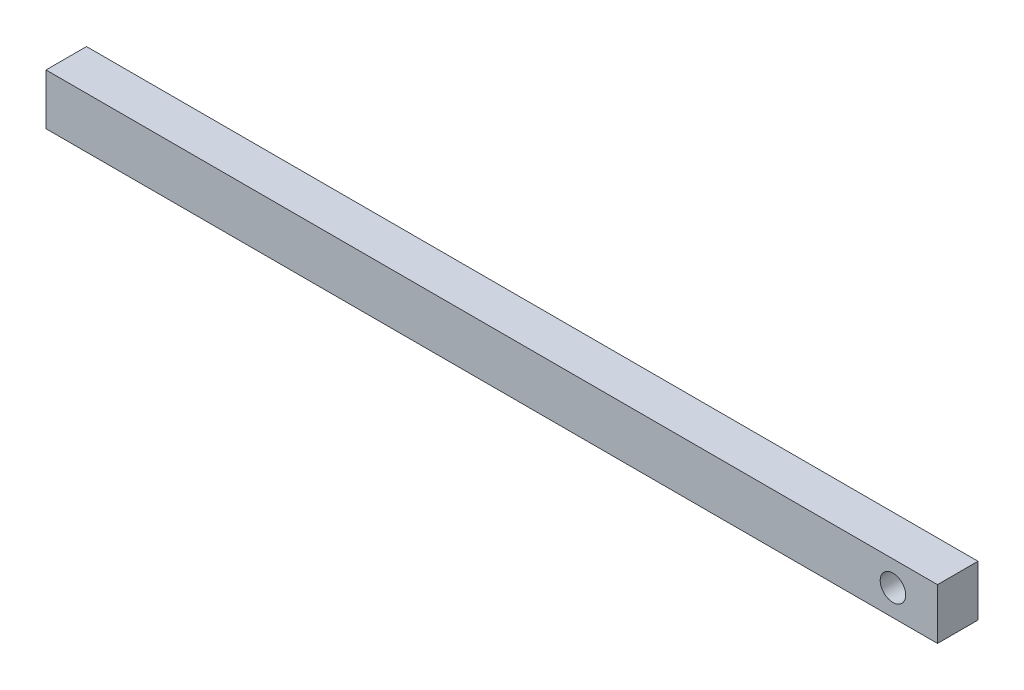
ISO-10303-21;
HEADER;
FILE_DESCRIPTION(('STEP AP214'),'2;1');
FILE_NAME('part.step','',(''),(''),'','','');
FILE_SCHEMA(('AUTOMOTIVE_DESIGN { 1 0 10303 214 1 1 1 1 }'));
ENDSEC;
DATA;
#1=APPLICATION_CONTEXT('core data for automotive mechanical design processes');
#2=APPLICATION_PROTOCOL_DEFINITION('international standard','automotive_design',2000,#1);
#3=PRODUCT_CONTEXT('',#1,'mechanical');
#4=PRODUCT('Part','Part','',(#3));
#5=PRODUCT_RELATED_PRODUCT_CATEGORY('part','',(#4));
#6=PRODUCT_DEFINITION_FORMATION('','',#4);
#7=PRODUCT_DEFINITION_CONTEXT('part definition',#1,'design');
#8=PRODUCT_DEFINITION('design','',#6,#7);
#9=PRODUCT_DEFINITION_SHAPE('','',#8);
#10=(LENGTH_UNIT() NAMED_UNIT(*) SI_UNIT(.MILLI.,.METRE.));
#11=(NAMED_UNIT(*) PLANE_ANGLE_UNIT() SI_UNIT($,.RADIAN.));
#12=(NAMED_UNIT(*) SI_UNIT($,.STERADIAN.) SOLID_ANGLE_UNIT());
#13=UNCERTAINTY_MEASURE_WITH_UNIT(LENGTH_MEASURE(1.E-05),#10,'distance_accuracy_value','');
#14=(GEOMETRIC_REPRESENTATION_CONTEXT(3) GLOBAL_UNCERTAINTY_ASSIGNED_CONTEXT((#13)) GLOBAL_UNIT_ASSIGNED_CONTEXT((#10,
#11,#12)) REPRESENTATION_CONTEXT('',''));
#15=CARTESIAN_POINT('',(0.,0.,0.));
#16=DIRECTION('',(0.,0.,1.));
#17=DIRECTION('',(1.,0.,0.));
#18=AXIS2_PLACEMENT_3D('',#15,#16,#17);
#19=CARTESIAN_POINT('',(0.,0.,3.18));
#20=DIRECTION('',(1.,0.,0.));
#21=DIRECTION('',(0.,0.,-1.));
#22=AXIS2_PLACEMENT_3D('',#19,#20,#21);
#23=PLANE('',#22);
#24=DIRECTION('',(0.,-1.,0.));
#25=VECTOR('',#24,1.);
#26=CARTESIAN_POINT('',(0.,0.,0.));
#27=LINE('',#26,#25);
#28=CARTESIAN_POINT('',(0.,4.,0.));
#29=VERTEX_POINT('',#28);
#30=CARTESIAN_POINT('',(0.,0.,0.));
#31=VERTEX_POINT('',#30);
#32=EDGE_CURVE('E101',#29,#31,#27,.T.);
#33=ORIENTED_EDGE('',*,*,#32,.T.);
#34=DIRECTION('',(0.,0.,-1.));
#35=VECTOR('',#34,1.);
#36=CARTESIAN_POINT('',(0.,0.,3.18));
#37=LINE('',#36,#35);
#38=CARTESIAN_POINT('',(0.,0.,3.18));
#39=VERTEX_POINT('',#38);
#40=EDGE_CURVE('E11',#39,#31,#37,.T.);
#41=ORIENTED_EDGE('',*,*,#40,.F.);
#42=DIRECTION('',(0.,-1.,0.));
#43=VECTOR('',#42,1.);
#44=CARTESIAN_POINT('',(0.,0.,3.18));
#45=LINE('',#44,#43);
#46=CARTESIAN_POINT('',(0.,4.,3.18));
#47=VERTEX_POINT('',#46);
#48=EDGE_CURVE('E88',#47,#39,#45,.T.);
#49=ORIENTED_EDGE('',*,*,#48,.F.);
#50=DIRECTION('',(0.,0.,-1.));
#51=VECTOR('',#50,1.);
#52=CARTESIAN_POINT('',(0.,4.,3.18));
#53=LINE('',#52,#51);
#54=EDGE_CURVE('E97',#47,#29,#53,.T.);
#55=ORIENTED_EDGE('',*,*,#54,.T.);
#56=EDGE_LOOP('',(#33,#41,#49,#55));
#57=FACE_BOUND('',#56,.T.);
#58=ADVANCED_FACE('F36',(#57),#23,.F.);
#59=CARTESIAN_POINT('',(0.,0.,3.18));
#60=DIRECTION('',(0.,1.,0.));
#61=DIRECTION('',(0.,0.,1.));
#62=AXIS2_PLACEMENT_3D('',#59,#60,#61);
#63=PLANE('',#62);
#64=DIRECTION('',(1.,0.,0.));
#65=VECTOR('',#64,1.);
#66=CARTESIAN_POINT('',(0.,0.,0.));
#67=LINE('',#66,#65);
#68=CARTESIAN_POINT('',(70.,0.,0.));
#69=VERTEX_POINT('',#68);
#70=EDGE_CURVE('E92',#31,#69,#67,.T.);
#71=ORIENTED_EDGE('',*,*,#70,.T.);
#72=DIRECTION('',(0.,0.,-1.));
#73=VECTOR('',#72,1.);
#74=CARTESIAN_POINT('',(70.,0.,3.18));
#75=LINE('',#74,#73);
#76=CARTESIAN_POINT('',(70.,0.,3.18));
#77=VERTEX_POINT('',#76);
#78=EDGE_CURVE('E45',#77,#69,#75,.T.);
#79=ORIENTED_EDGE('',*,*,#78,.F.);
#80=DIRECTION('',(1.,0.,0.));
#81=VECTOR('',#80,1.);
#82=CARTESIAN_POINT('',(0.,0.,3.18));
#83=LINE('',#82,#81);
#84=EDGE_CURVE('E83',#39,#77,#83,.T.);
#85=ORIENTED_EDGE('',*,*,#84,.F.);
#86=ORIENTED_EDGE('',*,*,#40,.T.);
#87=EDGE_LOOP('',(#71,#79,#85,#86));
#88=FACE_BOUND('',#87,.T.);
#89=ADVANCED_FACE('F91',(#88),#63,.F.);
#90=CARTESIAN_POINT('',(70.,0.,3.18));
#91=DIRECTION('',(-1.,0.,0.));
#92=DIRECTION('',(0.,0.,1.));
#93=AXIS2_PLACEMENT_3D('',#90,#91,#92);
#94=PLANE('',#93);
#95=DIRECTION('',(0.,1.,0.));
#96=VECTOR('',#95,1.);
#97=CARTESIAN_POINT('',(70.,0.,0.));
#98=LINE('',#97,#96);
#99=CARTESIAN_POINT('',(70.,4.,0.));
#100=VERTEX_POINT('',#99);
#101=EDGE_CURVE('E70',#69,#100,#98,.T.);
#102=ORIENTED_EDGE('',*,*,#101,.T.);
#103=DIRECTION('',(0.,0.,-1.));
#104=VECTOR('',#103,1.);
#105=CARTESIAN_POINT('',(70.,4.,3.18));
#106=LINE('',#105,#104);
#107=CARTESIAN_POINT('',(70.,4.,3.18));
#108=VERTEX_POINT('',#107);
#109=EDGE_CURVE('E93',#108,#100,#106,.T.);
#110=ORIENTED_EDGE('',*,*,#109,.F.);
#111=DIRECTION('',(0.,1.,0.));
#112=VECTOR('',#111,1.);
#113=CARTESIAN_POINT('',(70.,0.,3.18));
#114=LINE('',#113,#112);
#115=EDGE_CURVE('E86',#77,#108,#114,.T.);
#116=ORIENTED_EDGE('',*,*,#115,.F.);
#117=ORIENTED_EDGE('',*,*,#78,.T.);
#118=EDGE_LOOP('',(#102,#110,#116,#117));
#119=FACE_BOUND('',#118,.T.);
#120=ADVANCED_FACE('F95',(#119),#94,.F.);
#121=CARTESIAN_POINT('',(0.,4.,3.18));
#122=DIRECTION('',(0.,-1.,0.));
#123=DIRECTION('',(0.,0.,-1.));
#124=AXIS2_PLACEMENT_3D('',#121,#122,#123);
#125=PLANE('',#124);
#126=DIRECTION('',(-1.,0.,0.));
#127=VECTOR('',#126,1.);
#128=CARTESIAN_POINT('',(0.,4.,0.));
#129=LINE('',#128,#127);
#130=EDGE_CURVE('E76',#100,#29,#129,.T.);
#131=ORIENTED_EDGE('',*,*,#130,.T.);
#132=ORIENTED_EDGE('',*,*,#54,.F.);
#133=DIRECTION('',(-1.,0.,0.));
#134=VECTOR('',#133,1.);
#135=CARTESIAN_POINT('',(0.,4.,3.18));
#136=LINE('',#135,#134);
#137=EDGE_CURVE('E53',#108,#47,#136,.T.);
#138=ORIENTED_EDGE('',*,*,#137,.F.);
#139=ORIENTED_EDGE('',*,*,#109,.T.);
#140=EDGE_LOOP('',(#131,#132,#138,#139));
#141=FACE_BOUND('',#140,.T.);
#142=ADVANCED_FACE('F108',(#141),#125,.F.);
#143=CARTESIAN_POINT('',(0.,0.,3.18));
#144=DIRECTION('',(0.,0.,-1.));
#145=DIRECTION('',(-1.,0.,0.));
#146=AXIS2_PLACEMENT_3D('',#143,#144,#145);
#147=PLANE('',#146);
#148=CARTESIAN_POINT('',(66.5001733034826,2.03482950393317,3.18));
#149=DIRECTION('',(0.,0.,1.));
#150=DIRECTION('',(1.,0.,0.));
#151=AXIS2_PLACEMENT_3D('',#148,#149,#150);
#152=CIRCLE('',#151,0.999999999999998);
#153=CARTESIAN_POINT('',(67.5001733034826,2.03482950393317,3.18));
#154=VERTEX_POINT('',#153);
#155=EDGE_CURVE('E114',#154,#154,#152,.T.);
#156=ORIENTED_EDGE('',*,*,#155,.F.);
#157=EDGE_LOOP('',(#156));
#158=FACE_BOUND('',#157,.T.);
#159=ORIENTED_EDGE('',*,*,#48,.T.);
#160=ORIENTED_EDGE('',*,*,#84,.T.);
#161=ORIENTED_EDGE('',*,*,#115,.T.);
#162=ORIENTED_EDGE('',*,*,#137,.T.);
#163=EDGE_LOOP('',(#159,#160,#161,#162));
#164=FACE_BOUND('',#163,.T.);
#165=ADVANCED_FACE('F84',(#158,#164),#147,.F.);
#166=CARTESIAN_POINT('',(0.,0.,0.));
#167=DIRECTION('',(0.,0.,-1.));
#168=DIRECTION('',(-1.,0.,0.));
#169=AXIS2_PLACEMENT_3D('',#166,#167,#168);
#170=PLANE('',#169);
#171=CARTESIAN_POINT('',(66.5001733034826,2.03482950393317,0.));
#172=DIRECTION('',(0.,0.,-1.));
#173=DIRECTION('',(-1.,0.,0.));
#174=AXIS2_PLACEMENT_3D('',#171,#172,#173);
#175=CIRCLE('',#174,0.999999999999998);
#176=CARTESIAN_POINT('',(65.5001733034826,2.03482950393317,0.));
#177=VERTEX_POINT('',#176);
#178=EDGE_CURVE('E39',#177,#177,#175,.T.);
#179=ORIENTED_EDGE('',*,*,#178,.F.);
#180=EDGE_LOOP('',(#179));
#181=FACE_BOUND('',#180,.T.);
#182=ORIENTED_EDGE('',*,*,#32,.F.);
#183=ORIENTED_EDGE('',*,*,#130,.F.);
#184=ORIENTED_EDGE('',*,*,#101,.F.);
#185=ORIENTED_EDGE('',*,*,#70,.F.);
#186=EDGE_LOOP('',(#182,#183,#184,#185));
#187=FACE_BOUND('',#186,.T.);
#188=ADVANCED_FACE('F111',(#181,#187),#170,.T.);
#189=CARTESIAN_POINT('',(66.5001733034826,2.03482950393317,-6.82));
#190=DIRECTION('',(0.,0.,1.));
#191=DIRECTION('',(1.,0.,0.));
#192=AXIS2_PLACEMENT_3D('',#189,#190,#191);
#193=CYLINDRICAL_SURFACE('',#192,0.999999999999998);
#194=ORIENTED_EDGE('',*,*,#178,.T.);
#195=EDGE_LOOP('',(#194));
#196=FACE_BOUND('',#195,.T.);
#197=ORIENTED_EDGE('',*,*,#155,.T.);
#198=EDGE_LOOP('',(#197));
#199=FACE_BOUND('',#198,.T.);
#200=ADVANCED_FACE('F121',(#196,#199),#193,.F.);
#201=CLOSED_SHELL('',(#58,#89,#120,#142,#165,#188,#200));
#202=MANIFOLD_SOLID_BREP('B2',#201);
#203=ADVANCED_BREP_SHAPE_REPRESENTATION('',(#18,#202),#14);
#204=SHAPE_DEFINITION_REPRESENTATION(#9,#203);
ENDSEC;
END-ISO-10303-21;
